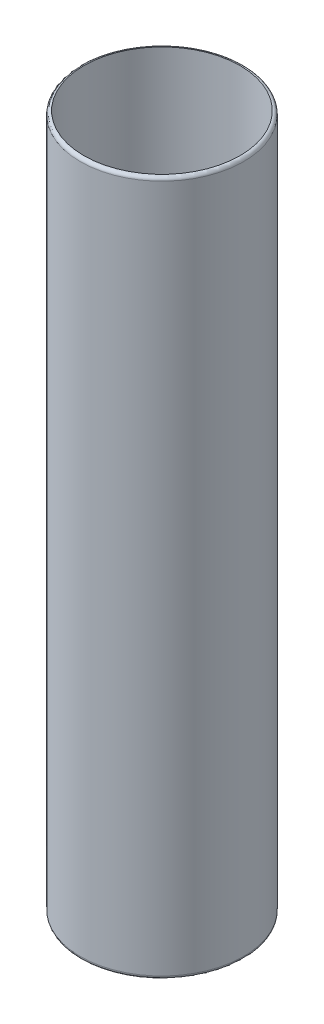
ISO-10303-21;
HEADER;
FILE_DESCRIPTION(('STEP AP214'),'2;1');
FILE_NAME('part.step','',(''),(''),'','','');
FILE_SCHEMA(('AUTOMOTIVE_DESIGN { 1 0 10303 214 1 1 1 1 }'));
ENDSEC;
DATA;
#1=APPLICATION_CONTEXT('core data for automotive mechanical design processes');
#2=APPLICATION_PROTOCOL_DEFINITION('international standard','automotive_design',2000,#1);
#3=PRODUCT_CONTEXT('',#1,'mechanical');
#4=PRODUCT('Part','Part','',(#3));
#5=PRODUCT_RELATED_PRODUCT_CATEGORY('part','',(#4));
#6=PRODUCT_DEFINITION_FORMATION('','',#4);
#7=PRODUCT_DEFINITION_CONTEXT('part definition',#1,'design');
#8=PRODUCT_DEFINITION('design','',#6,#7);
#9=PRODUCT_DEFINITION_SHAPE('','',#8);
#10=(LENGTH_UNIT() NAMED_UNIT(*) SI_UNIT(.MILLI.,.METRE.));
#11=(NAMED_UNIT(*) PLANE_ANGLE_UNIT() SI_UNIT($,.RADIAN.));
#12=(NAMED_UNIT(*) SI_UNIT($,.STERADIAN.) SOLID_ANGLE_UNIT());
#13=UNCERTAINTY_MEASURE_WITH_UNIT(LENGTH_MEASURE(1.E-05),#10,'distance_accuracy_value','');
#14=(GEOMETRIC_REPRESENTATION_CONTEXT(3) GLOBAL_UNCERTAINTY_ASSIGNED_CONTEXT((#13)) GLOBAL_UNIT_ASSIGNED_CONTEXT((#10,
#11,#12)) REPRESENTATION_CONTEXT('',''));
#15=CARTESIAN_POINT('',(0.,0.,0.));
#16=DIRECTION('',(0.,0.,1.));
#17=DIRECTION('',(1.,0.,0.));
#18=AXIS2_PLACEMENT_3D('',#15,#16,#17);
#19=CARTESIAN_POINT('',(0.,100.,0.));
#20=DIRECTION('',(0.,-1.,0.));
#21=DIRECTION('',(0.,0.,-1.));
#22=AXIS2_PLACEMENT_3D('',#19,#20,#21);
#23=CYLINDRICAL_SURFACE('',#22,11.73);
#24=CARTESIAN_POINT('',(0.,0.5,0.));
#25=DIRECTION('',(0.,1.,0.));
#26=DIRECTION('',(0.,0.,1.));
#27=AXIS2_PLACEMENT_3D('',#24,#25,#26);
#28=CIRCLE('',#27,11.73);
#29=CARTESIAN_POINT('',(0.,0.5,11.73));
#30=VERTEX_POINT('',#29);
#31=EDGE_CURVE('E10',#30,#30,#28,.T.);
#32=ORIENTED_EDGE('',*,*,#31,.T.);
#33=EDGE_LOOP('',(#32));
#34=FACE_BOUND('',#33,.T.);
#35=CARTESIAN_POINT('',(0.,99.5,0.));
#36=DIRECTION('',(0.,1.,0.));
#37=DIRECTION('',(0.,0.,1.));
#38=AXIS2_PLACEMENT_3D('',#35,#36,#37);
#39=CIRCLE('',#38,11.73);
#40=CARTESIAN_POINT('',(0.,99.5,11.73));
#41=VERTEX_POINT('',#40);
#42=EDGE_CURVE('E40',#41,#41,#39,.F.);
#43=ORIENTED_EDGE('',*,*,#42,.T.);
#44=EDGE_LOOP('',(#43));
#45=FACE_BOUND('',#44,.T.);
#46=ADVANCED_FACE('F33',(#34,#45),#23,.T.);
#47=CARTESIAN_POINT('',(0.,0.,0.));
#48=DIRECTION('',(0.,1.,0.));
#49=DIRECTION('',(0.,0.,1.));
#50=AXIS2_PLACEMENT_3D('',#47,#48,#49);
#51=CYLINDRICAL_SURFACE('',#50,11.23);
#52=CARTESIAN_POINT('',(0.,0.,0.));
#53=DIRECTION('',(0.,1.,0.));
#54=DIRECTION('',(0.,0.,1.));
#55=AXIS2_PLACEMENT_3D('',#52,#53,#54);
#56=CIRCLE('',#55,11.23);
#57=CARTESIAN_POINT('',(0.,0.,11.23));
#58=VERTEX_POINT('',#57);
#59=EDGE_CURVE('E44',#58,#58,#56,.T.);
#60=ORIENTED_EDGE('',*,*,#59,.F.);
#61=EDGE_LOOP('',(#60));
#62=FACE_BOUND('',#61,.T.);
#63=CARTESIAN_POINT('',(0.,100.,0.));
#64=DIRECTION('',(0.,1.,0.));
#65=DIRECTION('',(0.,0.,1.));
#66=AXIS2_PLACEMENT_3D('',#63,#64,#65);
#67=CIRCLE('',#66,11.23);
#68=CARTESIAN_POINT('',(0.,100.,11.23));
#69=VERTEX_POINT('',#68);
#70=EDGE_CURVE('E48',#69,#69,#67,.T.);
#71=ORIENTED_EDGE('',*,*,#70,.T.);
#72=EDGE_LOOP('',(#71));
#73=FACE_BOUND('',#72,.T.);
#74=ADVANCED_FACE('F54',(#62,#73),#51,.F.);
#75=CARTESIAN_POINT('',(0.,99.5,0.));
#76=DIRECTION('',(0.,1.,0.));
#77=DIRECTION('',(0.,0.,1.));
#78=AXIS2_PLACEMENT_3D('',#75,#76,#77);
#79=TOROIDAL_SURFACE('',#78,11.23,0.5);
#80=ORIENTED_EDGE('',*,*,#42,.F.);
#81=EDGE_LOOP('',(#80));
#82=FACE_BOUND('',#81,.T.);
#83=ORIENTED_EDGE('',*,*,#70,.F.);
#84=EDGE_LOOP('',(#83));
#85=FACE_BOUND('',#84,.T.);
#86=ADVANCED_FACE('F56',(#82,#85),#79,.T.);
#87=CARTESIAN_POINT('',(0.,0.5,0.));
#88=DIRECTION('',(0.,1.,0.));
#89=DIRECTION('',(0.,0.,1.));
#90=AXIS2_PLACEMENT_3D('',#87,#88,#89);
#91=TOROIDAL_SURFACE('',#90,11.23,0.5);
#92=ORIENTED_EDGE('',*,*,#59,.T.);
#93=EDGE_LOOP('',(#92));
#94=FACE_BOUND('',#93,.T.);
#95=ORIENTED_EDGE('',*,*,#31,.F.);
#96=EDGE_LOOP('',(#95));
#97=FACE_BOUND('',#96,.T.);
#98=ADVANCED_FACE('F35',(#94,#97),#91,.T.);
#99=CLOSED_SHELL('',(#46,#74,#86,#98));
#100=MANIFOLD_SOLID_BREP('B2',#99);
#101=ADVANCED_BREP_SHAPE_REPRESENTATION('',(#18,#100),#14);
#102=SHAPE_DEFINITION_REPRESENTATION(#9,#101);
ENDSEC;
END-ISO-10303-21;
